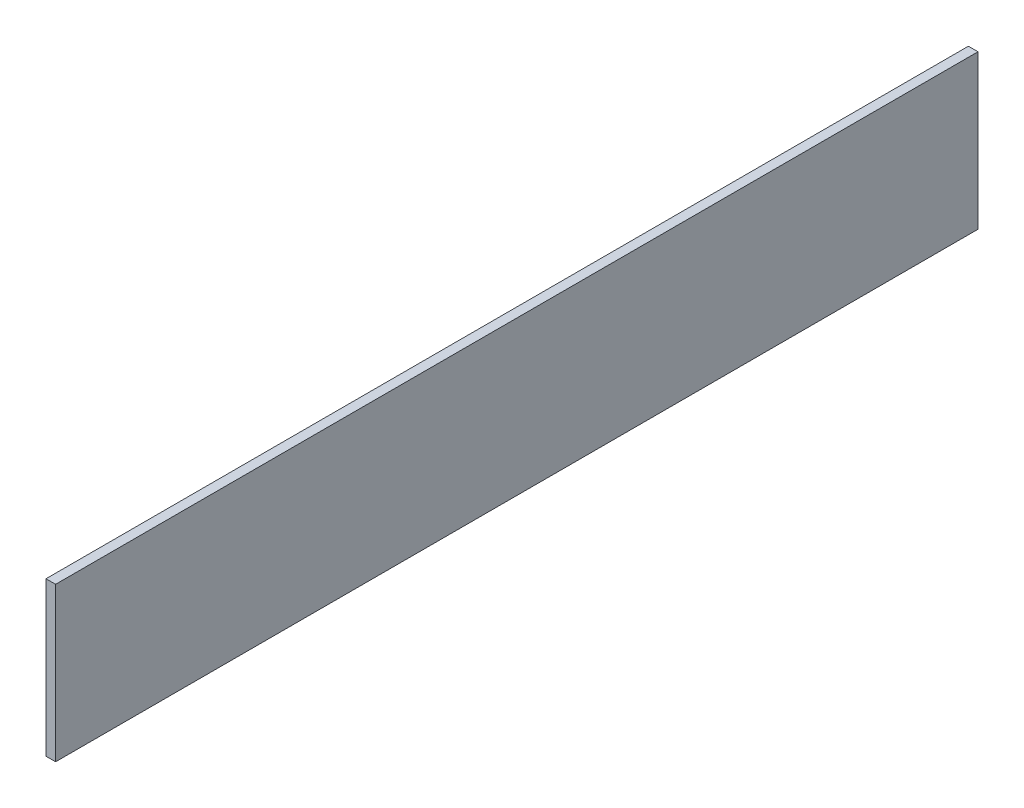
ISO-10303-21;
HEADER;
FILE_DESCRIPTION(('STEP AP214'),'2;1');
FILE_NAME('part.step','',(''),(''),'','','');
FILE_SCHEMA(('AUTOMOTIVE_DESIGN { 1 0 10303 214 1 1 1 1 }'));
ENDSEC;
DATA;
#1=APPLICATION_CONTEXT('core data for automotive mechanical design processes');
#2=APPLICATION_PROTOCOL_DEFINITION('international standard','automotive_design',2000,#1);
#3=PRODUCT_CONTEXT('',#1,'mechanical');
#4=PRODUCT('Part','Part','',(#3));
#5=PRODUCT_RELATED_PRODUCT_CATEGORY('part','',(#4));
#6=PRODUCT_DEFINITION_FORMATION('','',#4);
#7=PRODUCT_DEFINITION_CONTEXT('part definition',#1,'design');
#8=PRODUCT_DEFINITION('design','',#6,#7);
#9=PRODUCT_DEFINITION_SHAPE('','',#8);
#10=(LENGTH_UNIT() NAMED_UNIT(*) SI_UNIT(.MILLI.,.METRE.));
#11=(NAMED_UNIT(*) PLANE_ANGLE_UNIT() SI_UNIT($,.RADIAN.));
#12=(NAMED_UNIT(*) SI_UNIT($,.STERADIAN.) SOLID_ANGLE_UNIT());
#13=UNCERTAINTY_MEASURE_WITH_UNIT(LENGTH_MEASURE(1.E-05),#10,'distance_accuracy_value','');
#14=(GEOMETRIC_REPRESENTATION_CONTEXT(3) GLOBAL_UNCERTAINTY_ASSIGNED_CONTEXT((#13)) GLOBAL_UNIT_ASSIGNED_CONTEXT((#10,
#11,#12)) REPRESENTATION_CONTEXT('',''));
#15=CARTESIAN_POINT('',(0.,0.,0.));
#16=DIRECTION('',(0.,0.,1.));
#17=DIRECTION('',(1.,0.,0.));
#18=AXIS2_PLACEMENT_3D('',#15,#16,#17);
#19=CARTESIAN_POINT('',(1.5875,0.,0.));
#20=DIRECTION('',(0.,0.,-1.));
#21=DIRECTION('',(-1.,0.,0.));
#22=AXIS2_PLACEMENT_3D('',#19,#20,#21);
#23=PLANE('',#22);
#24=DIRECTION('',(0.,-1.,0.));
#25=VECTOR('',#24,1.);
#26=CARTESIAN_POINT('',(0.,0.,0.));
#27=LINE('',#26,#25);
#28=CARTESIAN_POINT('',(0.,25.4,0.));
#29=VERTEX_POINT('',#28);
#30=CARTESIAN_POINT('',(0.,0.,0.));
#31=VERTEX_POINT('',#30);
#32=EDGE_CURVE('E96',#29,#31,#27,.T.);
#33=ORIENTED_EDGE('',*,*,#32,.T.);
#34=DIRECTION('',(-1.,0.,0.));
#35=VECTOR('',#34,1.);
#36=CARTESIAN_POINT('',(1.5875,0.,0.));
#37=LINE('',#36,#35);
#38=CARTESIAN_POINT('',(1.5875,0.,0.));
#39=VERTEX_POINT('',#38);
#40=EDGE_CURVE('E11',#39,#31,#37,.T.);
#41=ORIENTED_EDGE('',*,*,#40,.F.);
#42=DIRECTION('',(0.,-1.,0.));
#43=VECTOR('',#42,1.);
#44=CARTESIAN_POINT('',(1.5875,0.,0.));
#45=LINE('',#44,#43);
#46=CARTESIAN_POINT('',(1.5875,25.4,0.));
#47=VERTEX_POINT('',#46);
#48=EDGE_CURVE('E84',#47,#39,#45,.T.);
#49=ORIENTED_EDGE('',*,*,#48,.F.);
#50=DIRECTION('',(-1.,0.,0.));
#51=VECTOR('',#50,1.);
#52=CARTESIAN_POINT('',(1.5875,25.4,0.));
#53=LINE('',#52,#51);
#54=EDGE_CURVE('E92',#47,#29,#53,.T.);
#55=ORIENTED_EDGE('',*,*,#54,.T.);
#56=EDGE_LOOP('',(#33,#41,#49,#55));
#57=FACE_BOUND('',#56,.T.);
#58=ADVANCED_FACE('F33',(#57),#23,.F.);
#59=CARTESIAN_POINT('',(1.5875,0.,0.));
#60=DIRECTION('',(0.,1.,0.));
#61=DIRECTION('',(0.,0.,1.));
#62=AXIS2_PLACEMENT_3D('',#59,#60,#61);
#63=PLANE('',#62);
#64=DIRECTION('',(0.,0.,-1.));
#65=VECTOR('',#64,1.);
#66=CARTESIAN_POINT('',(0.,0.,0.));
#67=LINE('',#66,#65);
#68=CARTESIAN_POINT('',(0.,0.,-152.4));
#69=VERTEX_POINT('',#68);
#70=EDGE_CURVE('E88',#31,#69,#67,.T.);
#71=ORIENTED_EDGE('',*,*,#70,.T.);
#72=DIRECTION('',(-1.,0.,0.));
#73=VECTOR('',#72,1.);
#74=CARTESIAN_POINT('',(1.5875,0.,-152.4));
#75=LINE('',#74,#73);
#76=CARTESIAN_POINT('',(1.5875,0.,-152.4));
#77=VERTEX_POINT('',#76);
#78=EDGE_CURVE('E41',#77,#69,#75,.T.);
#79=ORIENTED_EDGE('',*,*,#78,.F.);
#80=DIRECTION('',(0.,0.,-1.));
#81=VECTOR('',#80,1.);
#82=CARTESIAN_POINT('',(1.5875,0.,0.));
#83=LINE('',#82,#81);
#84=EDGE_CURVE('E79',#39,#77,#83,.T.);
#85=ORIENTED_EDGE('',*,*,#84,.F.);
#86=ORIENTED_EDGE('',*,*,#40,.T.);
#87=EDGE_LOOP('',(#71,#79,#85,#86));
#88=FACE_BOUND('',#87,.T.);
#89=ADVANCED_FACE('F87',(#88),#63,.F.);
#90=CARTESIAN_POINT('',(1.5875,0.,-152.4));
#91=DIRECTION('',(0.,0.,1.));
#92=DIRECTION('',(1.,0.,0.));
#93=AXIS2_PLACEMENT_3D('',#90,#91,#92);
#94=PLANE('',#93);
#95=DIRECTION('',(0.,1.,0.));
#96=VECTOR('',#95,1.);
#97=CARTESIAN_POINT('',(0.,0.,-152.4));
#98=LINE('',#97,#96);
#99=CARTESIAN_POINT('',(0.,25.4,-152.4));
#100=VERTEX_POINT('',#99);
#101=EDGE_CURVE('E66',#69,#100,#98,.T.);
#102=ORIENTED_EDGE('',*,*,#101,.T.);
#103=DIRECTION('',(-1.,0.,0.));
#104=VECTOR('',#103,1.);
#105=CARTESIAN_POINT('',(1.5875,25.4,-152.4));
#106=LINE('',#105,#104);
#107=CARTESIAN_POINT('',(1.5875,25.4,-152.4));
#108=VERTEX_POINT('',#107);
#109=EDGE_CURVE('E89',#108,#100,#106,.T.);
#110=ORIENTED_EDGE('',*,*,#109,.F.);
#111=DIRECTION('',(0.,1.,0.));
#112=VECTOR('',#111,1.);
#113=CARTESIAN_POINT('',(1.5875,0.,-152.4));
#114=LINE('',#113,#112);
#115=EDGE_CURVE('E82',#77,#108,#114,.T.);
#116=ORIENTED_EDGE('',*,*,#115,.F.);
#117=ORIENTED_EDGE('',*,*,#78,.T.);
#118=EDGE_LOOP('',(#102,#110,#116,#117));
#119=FACE_BOUND('',#118,.T.);
#120=ADVANCED_FACE('F90',(#119),#94,.F.);
#121=CARTESIAN_POINT('',(1.5875,25.4,0.));
#122=DIRECTION('',(0.,-1.,0.));
#123=DIRECTION('',(0.,0.,-1.));
#124=AXIS2_PLACEMENT_3D('',#121,#122,#123);
#125=PLANE('',#124);
#126=DIRECTION('',(0.,0.,1.));
#127=VECTOR('',#126,1.);
#128=CARTESIAN_POINT('',(0.,25.4,0.));
#129=LINE('',#128,#127);
#130=EDGE_CURVE('E72',#100,#29,#129,.T.);
#131=ORIENTED_EDGE('',*,*,#130,.T.);
#132=ORIENTED_EDGE('',*,*,#54,.F.);
#133=DIRECTION('',(0.,0.,1.));
#134=VECTOR('',#133,1.);
#135=CARTESIAN_POINT('',(1.5875,25.4,0.));
#136=LINE('',#135,#134);
#137=EDGE_CURVE('E49',#108,#47,#136,.T.);
#138=ORIENTED_EDGE('',*,*,#137,.F.);
#139=ORIENTED_EDGE('',*,*,#109,.T.);
#140=EDGE_LOOP('',(#131,#132,#138,#139));
#141=FACE_BOUND('',#140,.T.);
#142=ADVANCED_FACE('F103',(#141),#125,.F.);
#143=CARTESIAN_POINT('',(1.5875,0.,0.));
#144=DIRECTION('',(-1.,0.,0.));
#145=DIRECTION('',(0.,0.,1.));
#146=AXIS2_PLACEMENT_3D('',#143,#144,#145);
#147=PLANE('',#146);
#148=ORIENTED_EDGE('',*,*,#48,.T.);
#149=ORIENTED_EDGE('',*,*,#84,.T.);
#150=ORIENTED_EDGE('',*,*,#115,.T.);
#151=ORIENTED_EDGE('',*,*,#137,.T.);
#152=EDGE_LOOP('',(#148,#149,#150,#151));
#153=FACE_BOUND('',#152,.T.);
#154=ADVANCED_FACE('F80',(#153),#147,.F.);
#155=CARTESIAN_POINT('',(0.,0.,0.));
#156=DIRECTION('',(-1.,0.,0.));
#157=DIRECTION('',(0.,0.,1.));
#158=AXIS2_PLACEMENT_3D('',#155,#156,#157);
#159=PLANE('',#158);
#160=ORIENTED_EDGE('',*,*,#32,.F.);
#161=ORIENTED_EDGE('',*,*,#130,.F.);
#162=ORIENTED_EDGE('',*,*,#101,.F.);
#163=ORIENTED_EDGE('',*,*,#70,.F.);
#164=EDGE_LOOP('',(#160,#161,#162,#163));
#165=FACE_BOUND('',#164,.T.);
#166=ADVANCED_FACE('F106',(#165),#159,.T.);
#167=CLOSED_SHELL('',(#58,#89,#120,#142,#154,#166));
#168=MANIFOLD_SOLID_BREP('B2',#167);
#169=ADVANCED_BREP_SHAPE_REPRESENTATION('',(#18,#168),#14);
#170=SHAPE_DEFINITION_REPRESENTATION(#9,#169);
ENDSEC;
END-ISO-10303-21;
